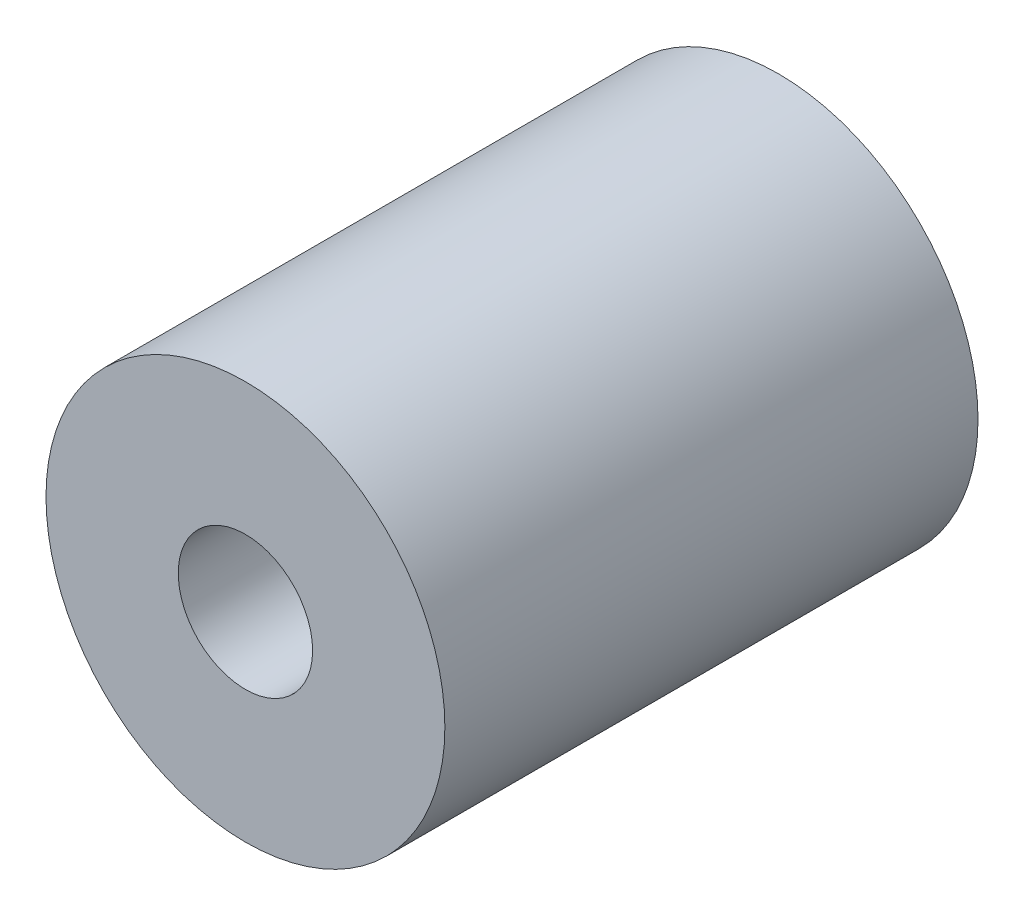
ISO-10303-21;
HEADER;
FILE_DESCRIPTION(('STEP AP214'),'2;1');
FILE_NAME('part.step','',(''),(''),'','','');
FILE_SCHEMA(('AUTOMOTIVE_DESIGN { 1 0 10303 214 1 1 1 1 }'));
ENDSEC;
DATA;
#1=APPLICATION_CONTEXT('core data for automotive mechanical design processes');
#2=APPLICATION_PROTOCOL_DEFINITION('international standard','automotive_design',2000,#1);
#3=PRODUCT_CONTEXT('',#1,'mechanical');
#4=PRODUCT('Part','Part','',(#3));
#5=PRODUCT_RELATED_PRODUCT_CATEGORY('part','',(#4));
#6=PRODUCT_DEFINITION_FORMATION('','',#4);
#7=PRODUCT_DEFINITION_CONTEXT('part definition',#1,'design');
#8=PRODUCT_DEFINITION('design','',#6,#7);
#9=PRODUCT_DEFINITION_SHAPE('','',#8);
#10=(LENGTH_UNIT() NAMED_UNIT(*) SI_UNIT(.MILLI.,.METRE.));
#11=(NAMED_UNIT(*) PLANE_ANGLE_UNIT() SI_UNIT($,.RADIAN.));
#12=(NAMED_UNIT(*) SI_UNIT($,.STERADIAN.) SOLID_ANGLE_UNIT());
#13=UNCERTAINTY_MEASURE_WITH_UNIT(LENGTH_MEASURE(1.E-05),#10,'distance_accuracy_value','');
#14=(GEOMETRIC_REPRESENTATION_CONTEXT(3) GLOBAL_UNCERTAINTY_ASSIGNED_CONTEXT((#13)) GLOBAL_UNIT_ASSIGNED_CONTEXT((#10,
#11,#12)) REPRESENTATION_CONTEXT('',''));
#15=CARTESIAN_POINT('',(0.,0.,0.));
#16=DIRECTION('',(0.,0.,1.));
#17=DIRECTION('',(1.,0.,0.));
#18=AXIS2_PLACEMENT_3D('',#15,#16,#17);
#19=CARTESIAN_POINT('',(0.,0.,40.31615));
#20=DIRECTION('',(0.,0.,1.));
#21=DIRECTION('',(1.,0.,0.));
#22=AXIS2_PLACEMENT_3D('',#19,#20,#21);
#23=PLANE('',#22);
#24=CARTESIAN_POINT('',(0.,0.,40.31615));
#25=DIRECTION('',(0.,0.,1.));
#26=DIRECTION('',(1.,0.,0.));
#27=AXIS2_PLACEMENT_3D('',#24,#25,#26);
#28=CIRCLE('',#27,15.08125);
#29=CARTESIAN_POINT('',(15.08125,0.,40.31615));
#30=VERTEX_POINT('',#29);
#31=EDGE_CURVE('E10',#30,#30,#28,.T.);
#32=ORIENTED_EDGE('',*,*,#31,.T.);
#33=EDGE_LOOP('',(#32));
#34=FACE_BOUND('',#33,.T.);
#35=CARTESIAN_POINT('',(0.,0.,40.31615));
#36=DIRECTION('',(0.,0.,1.));
#37=DIRECTION('',(1.,0.,0.));
#38=AXIS2_PLACEMENT_3D('',#35,#36,#37);
#39=CIRCLE('',#38,5.08);
#40=CARTESIAN_POINT('',(5.08,0.,40.31615));
#41=VERTEX_POINT('',#40);
#42=EDGE_CURVE('E56',#41,#41,#39,.T.);
#43=ORIENTED_EDGE('',*,*,#42,.F.);
#44=EDGE_LOOP('',(#43));
#45=FACE_BOUND('',#44,.T.);
#46=ADVANCED_FACE('F43',(#34,#45),#23,.T.);
#47=CARTESIAN_POINT('',(0.,0.,0.));
#48=DIRECTION('',(0.,0.,1.));
#49=DIRECTION('',(1.,0.,0.));
#50=AXIS2_PLACEMENT_3D('',#47,#48,#49);
#51=PLANE('',#50);
#52=CARTESIAN_POINT('',(0.,0.,0.));
#53=DIRECTION('',(0.,0.,1.));
#54=DIRECTION('',(1.,0.,0.));
#55=AXIS2_PLACEMENT_3D('',#52,#53,#54);
#56=CIRCLE('',#55,15.08125);
#57=CARTESIAN_POINT('',(15.08125,0.,0.));
#58=VERTEX_POINT('',#57);
#59=EDGE_CURVE('E47',#58,#58,#56,.T.);
#60=ORIENTED_EDGE('',*,*,#59,.F.);
#61=EDGE_LOOP('',(#60));
#62=FACE_BOUND('',#61,.T.);
#63=CARTESIAN_POINT('',(0.,0.,0.));
#64=DIRECTION('',(0.,0.,1.));
#65=DIRECTION('',(1.,0.,0.));
#66=AXIS2_PLACEMENT_3D('',#63,#64,#65);
#67=CIRCLE('',#66,5.08);
#68=CARTESIAN_POINT('',(5.08,0.,0.));
#69=VERTEX_POINT('',#68);
#70=EDGE_CURVE('E58',#69,#69,#67,.T.);
#71=ORIENTED_EDGE('',*,*,#70,.T.);
#72=EDGE_LOOP('',(#71));
#73=FACE_BOUND('',#72,.T.);
#74=ADVANCED_FACE('F70',(#62,#73),#51,.F.);
#75=CARTESIAN_POINT('',(0.,0.,40.31615));
#76=DIRECTION('',(0.,0.,-1.));
#77=DIRECTION('',(-1.,0.,0.));
#78=AXIS2_PLACEMENT_3D('',#75,#76,#77);
#79=CYLINDRICAL_SURFACE('',#78,15.08125);
#80=ORIENTED_EDGE('',*,*,#31,.F.);
#81=EDGE_LOOP('',(#80));
#82=FACE_BOUND('',#81,.T.);
#83=ORIENTED_EDGE('',*,*,#59,.T.);
#84=EDGE_LOOP('',(#83));
#85=FACE_BOUND('',#84,.T.);
#86=ADVANCED_FACE('F45',(#82,#85),#79,.T.);
#87=CARTESIAN_POINT('',(0.,0.,40.31615));
#88=DIRECTION('',(0.,0.,-1.));
#89=DIRECTION('',(-1.,0.,0.));
#90=AXIS2_PLACEMENT_3D('',#87,#88,#89);
#91=CYLINDRICAL_SURFACE('',#90,5.08);
#92=ORIENTED_EDGE('',*,*,#42,.T.);
#93=EDGE_LOOP('',(#92));
#94=FACE_BOUND('',#93,.T.);
#95=ORIENTED_EDGE('',*,*,#70,.F.);
#96=EDGE_LOOP('',(#95));
#97=FACE_BOUND('',#96,.T.);
#98=ADVANCED_FACE('F66',(#94,#97),#91,.F.);
#99=CLOSED_SHELL('',(#46,#74,#86,#98));
#100=MANIFOLD_SOLID_BREP('B2',#99);
#101=ADVANCED_BREP_SHAPE_REPRESENTATION('',(#18,#100),#14);
#102=SHAPE_DEFINITION_REPRESENTATION(#9,#101);
ENDSEC;
END-ISO-10303-21;
